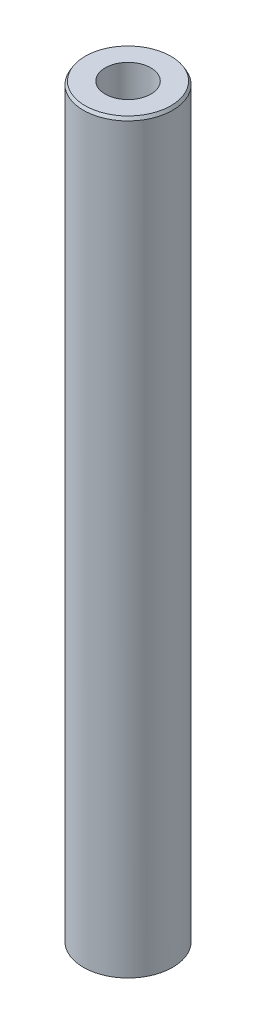
ISO-10303-21;
HEADER;
FILE_DESCRIPTION(('STEP AP214'),'2;1');
FILE_NAME('part.step','',(''),(''),'','','');
FILE_SCHEMA(('AUTOMOTIVE_DESIGN { 1 0 10303 214 1 1 1 1 }'));
ENDSEC;
DATA;
#1=APPLICATION_CONTEXT('core data for automotive mechanical design processes');
#2=APPLICATION_PROTOCOL_DEFINITION('international standard','automotive_design',2000,#1);
#3=PRODUCT_CONTEXT('',#1,'mechanical');
#4=PRODUCT('Part','Part','',(#3));
#5=PRODUCT_RELATED_PRODUCT_CATEGORY('part','',(#4));
#6=PRODUCT_DEFINITION_FORMATION('','',#4);
#7=PRODUCT_DEFINITION_CONTEXT('part definition',#1,'design');
#8=PRODUCT_DEFINITION('design','',#6,#7);
#9=PRODUCT_DEFINITION_SHAPE('','',#8);
#10=(LENGTH_UNIT() NAMED_UNIT(*) SI_UNIT(.MILLI.,.METRE.));
#11=(NAMED_UNIT(*) PLANE_ANGLE_UNIT() SI_UNIT($,.RADIAN.));
#12=(NAMED_UNIT(*) SI_UNIT($,.STERADIAN.) SOLID_ANGLE_UNIT());
#13=UNCERTAINTY_MEASURE_WITH_UNIT(LENGTH_MEASURE(1.E-05),#10,'distance_accuracy_value','');
#14=(GEOMETRIC_REPRESENTATION_CONTEXT(3) GLOBAL_UNCERTAINTY_ASSIGNED_CONTEXT((#13)) GLOBAL_UNIT_ASSIGNED_CONTEXT((#10,
#11,#12)) REPRESENTATION_CONTEXT('',''));
#15=CARTESIAN_POINT('',(0.,0.,0.));
#16=DIRECTION('',(0.,0.,1.));
#17=DIRECTION('',(1.,0.,0.));
#18=AXIS2_PLACEMENT_3D('',#15,#16,#17);
#19=CARTESIAN_POINT('',(0.,167.340942336388,0.));
#20=DIRECTION('',(0.,-1.,0.));
#21=DIRECTION('',(0.,0.,-1.));
#22=AXIS2_PLACEMENT_3D('',#19,#20,#21);
#23=CYLINDRICAL_SURFACE('',#22,10.);
#24=CARTESIAN_POINT('',(0.,166.655777422536,0.));
#25=DIRECTION('',(0.,1.,0.));
#26=DIRECTION('',(0.,0.,1.));
#27=AXIS2_PLACEMENT_3D('',#24,#25,#26);
#28=CIRCLE('',#27,10.);
#29=CARTESIAN_POINT('',(0.,166.655777422536,-10.));
#30=VERTEX_POINT('',#29);
#31=EDGE_CURVE('E50',#30,#30,#28,.F.);
#32=ORIENTED_EDGE('',*,*,#31,.T.);
#33=EDGE_LOOP('',(#32));
#34=FACE_BOUND('',#33,.T.);
#35=CARTESIAN_POINT('',(0.,0.395580147452029,0.));
#36=DIRECTION('',(0.,1.,0.));
#37=DIRECTION('',(0.,0.,1.));
#38=AXIS2_PLACEMENT_3D('',#35,#36,#37);
#39=CIRCLE('',#38,10.);
#40=CARTESIAN_POINT('',(0.,0.395580147452029,10.));
#41=VERTEX_POINT('',#40);
#42=EDGE_CURVE('E51',#41,#41,#39,.T.);
#43=ORIENTED_EDGE('',*,*,#42,.T.);
#44=EDGE_LOOP('',(#43));
#45=FACE_BOUND('',#44,.T.);
#46=ADVANCED_FACE('F39',(#34,#45),#23,.T.);
#47=CARTESIAN_POINT('',(0.,167.340942336388,0.));
#48=DIRECTION('',(0.,1.,0.));
#49=DIRECTION('',(0.,0.,1.));
#50=AXIS2_PLACEMENT_3D('',#47,#48,#49);
#51=PLANE('',#50);
#52=CARTESIAN_POINT('',(0.,167.340942336388,0.));
#53=DIRECTION('',(0.,1.,0.));
#54=DIRECTION('',(0.,0.,1.));
#55=AXIS2_PLACEMENT_3D('',#52,#53,#54);
#56=CIRCLE('',#55,9.60441985254797);
#57=CARTESIAN_POINT('',(0.,167.340942336388,-9.60441985254797));
#58=VERTEX_POINT('',#57);
#59=EDGE_CURVE('E54',#58,#58,#56,.T.);
#60=ORIENTED_EDGE('',*,*,#59,.T.);
#61=EDGE_LOOP('',(#60));
#62=FACE_BOUND('',#61,.T.);
#63=CARTESIAN_POINT('',(0.,167.340942336388,0.));
#64=DIRECTION('',(0.,1.,0.));
#65=DIRECTION('',(0.,0.,1.));
#66=AXIS2_PLACEMENT_3D('',#63,#64,#65);
#67=CIRCLE('',#66,5.11390943637588);
#68=CARTESIAN_POINT('',(0.,167.340942336388,5.11390943637588));
#69=VERTEX_POINT('',#68);
#70=EDGE_CURVE('E58',#69,#69,#67,.T.);
#71=ORIENTED_EDGE('',*,*,#70,.F.);
#72=EDGE_LOOP('',(#71));
#73=FACE_BOUND('',#72,.T.);
#74=ADVANCED_FACE('F69',(#62,#73),#51,.T.);
#75=CARTESIAN_POINT('',(0.,0.,0.));
#76=DIRECTION('',(0.,1.,0.));
#77=DIRECTION('',(0.,0.,1.));
#78=AXIS2_PLACEMENT_3D('',#75,#76,#77);
#79=PLANE('',#78);
#80=CARTESIAN_POINT('',(0.,0.,0.));
#81=DIRECTION('',(0.,1.,0.));
#82=DIRECTION('',(0.,0.,1.));
#83=AXIS2_PLACEMENT_3D('',#80,#81,#82);
#84=CIRCLE('',#83,9.3148350861475);
#85=CARTESIAN_POINT('',(0.,0.,9.3148350861475));
#86=VERTEX_POINT('',#85);
#87=EDGE_CURVE('E10',#86,#86,#84,.F.);
#88=ORIENTED_EDGE('',*,*,#87,.T.);
#89=EDGE_LOOP('',(#88));
#90=FACE_BOUND('',#89,.T.);
#91=CARTESIAN_POINT('',(0.,0.,0.));
#92=DIRECTION('',(0.,1.,0.));
#93=DIRECTION('',(0.,0.,1.));
#94=AXIS2_PLACEMENT_3D('',#91,#92,#93);
#95=CIRCLE('',#94,5.11390943637588);
#96=CARTESIAN_POINT('',(0.,0.,5.11390943637588));
#97=VERTEX_POINT('',#96);
#98=EDGE_CURVE('E63',#97,#97,#95,.T.);
#99=ORIENTED_EDGE('',*,*,#98,.T.);
#100=EDGE_LOOP('',(#99));
#101=FACE_BOUND('',#100,.T.);
#102=ADVANCED_FACE('F75',(#90,#101),#79,.F.);
#103=CARTESIAN_POINT('',(0.,167.340942336388,0.));
#104=DIRECTION('',(0.,-1.,0.));
#105=DIRECTION('',(0.,0.,-1.));
#106=AXIS2_PLACEMENT_3D('',#103,#104,#105);
#107=CYLINDRICAL_SURFACE('',#106,5.11390943637588);
#108=ORIENTED_EDGE('',*,*,#70,.T.);
#109=EDGE_LOOP('',(#108));
#110=FACE_BOUND('',#109,.T.);
#111=ORIENTED_EDGE('',*,*,#98,.F.);
#112=EDGE_LOOP('',(#111));
#113=FACE_BOUND('',#112,.T.);
#114=ADVANCED_FACE('F70',(#110,#113),#107,.F.);
#115=CARTESIAN_POINT('',(0.,167.340942336388,0.));
#116=DIRECTION('',(0.,-1.,0.));
#117=DIRECTION('',(0.,0.,-1.));
#118=AXIS2_PLACEMENT_3D('',#115,#116,#117);
#119=CONICAL_SURFACE('',#118,9.60441985254797,0.523598775598283);
#120=CARTESIAN_POINT('',(0.,166.655777422536,-10.));
#121=CARTESIAN_POINT('',(0.,166.662914557055,-9.99587937346405));
#122=CARTESIAN_POINT('',(0.,166.670051691574,-9.99175874692809));
#123=CARTESIAN_POINT('',(0.,166.684325960613,-9.98351749385617));
#124=CARTESIAN_POINT('',(0.,166.691463095132,-9.97939686732021));
#125=CARTESIAN_POINT('',(0.,166.705737364171,-9.97115561424829));
#126=CARTESIAN_POINT('',(0.,166.71287449869,-9.96703498771234));
#127=CARTESIAN_POINT('',(0.,166.727148767729,-9.95879373464042));
#128=CARTESIAN_POINT('',(0.,166.734285902248,-9.95467310810446));
#129=CARTESIAN_POINT('',(0.,166.748560171287,-9.94643185503254));
#130=CARTESIAN_POINT('',(0.,166.755697305806,-9.94231122849659));
#131=CARTESIAN_POINT('',(0.,166.769971574845,-9.93406997542467));
#132=CARTESIAN_POINT('',(0.,166.777108709364,-9.92994934888871));
#133=CARTESIAN_POINT('',(0.,166.791382978402,-9.92170809581679));
#134=CARTESIAN_POINT('',(0.,166.798520112922,-9.91758746928083));
#135=CARTESIAN_POINT('',(0.,166.81279438196,-9.90934621620891));
#136=CARTESIAN_POINT('',(0.,166.81993151648,-9.90522558967296));
#137=CARTESIAN_POINT('',(0.,166.834205785518,-9.89698433660104));
#138=CARTESIAN_POINT('',(0.,166.841342920038,-9.89286371006508));
#139=CARTESIAN_POINT('',(0.,166.855617189076,-9.88462245699316));
#140=CARTESIAN_POINT('',(0.,166.862754323595,-9.88050183045721));
#141=CARTESIAN_POINT('',(0.,166.877028592634,-9.87226057738529));
#142=CARTESIAN_POINT('',(0.,166.884165727153,-9.86813995084933));
#143=CARTESIAN_POINT('',(0.,166.898439996192,-9.85989869777741));
#144=CARTESIAN_POINT('',(0.,166.905577130711,-9.85577807124145));
#145=CARTESIAN_POINT('',(0.,166.91985139975,-9.84753681816953));
#146=CARTESIAN_POINT('',(0.,166.926988534269,-9.84341619163358));
#147=CARTESIAN_POINT('',(0.,166.941262803308,-9.83517493856166));
#148=CARTESIAN_POINT('',(0.,166.948399937827,-9.8310543120257));
#149=CARTESIAN_POINT('',(0.,166.962674206866,-9.82281305895378));
#150=CARTESIAN_POINT('',(0.,166.969811341385,-9.81869243241783));
#151=CARTESIAN_POINT('',(0.,166.984085610424,-9.81045117934591));
#152=CARTESIAN_POINT('',(0.,166.991222744943,-9.80633055280995));
#153=CARTESIAN_POINT('',(0.,167.005497013981,-9.79808929973803));
#154=CARTESIAN_POINT('',(0.,167.012634148501,-9.79396867320207));
#155=CARTESIAN_POINT('',(0.,167.026908417539,-9.78572742013016));
#156=CARTESIAN_POINT('',(0.,167.034045552059,-9.7816067935942));
#157=CARTESIAN_POINT('',(0.,167.048319821097,-9.77336554052228));
#158=CARTESIAN_POINT('',(0.,167.055456955616,-9.76924491398632));
#159=CARTESIAN_POINT('',(0.,167.069731224655,-9.7610036609144));
#160=CARTESIAN_POINT('',(0.,167.076868359174,-9.75688303437845));
#161=CARTESIAN_POINT('',(0.,167.091142628213,-9.74864178130653));
#162=CARTESIAN_POINT('',(0.,167.098279762732,-9.74452115477057));
#163=CARTESIAN_POINT('',(0.,167.112554031771,-9.73627990169865));
#164=CARTESIAN_POINT('',(0.,167.11969116629,-9.73215927516269));
#165=CARTESIAN_POINT('',(0.,167.133965435329,-9.72391802209077));
#166=CARTESIAN_POINT('',(0.,167.141102569848,-9.71979739555482));
#167=CARTESIAN_POINT('',(0.,167.155376838887,-9.7115561424829));
#168=CARTESIAN_POINT('',(0.,167.162513973406,-9.70743551594694));
#169=CARTESIAN_POINT('',(0.,167.176788242445,-9.69919426287502));
#170=CARTESIAN_POINT('',(0.,167.183925376964,-9.69507363633907));
#171=CARTESIAN_POINT('',(0.,167.198199646002,-9.68683238326715));
#172=CARTESIAN_POINT('',(0.,167.205336780522,-9.68271175673119));
#173=CARTESIAN_POINT('',(0.,167.21961104956,-9.67447050365927));
#174=CARTESIAN_POINT('',(0.,167.22674818408,-9.67034987712331));
#175=CARTESIAN_POINT('',(0.,167.241022453118,-9.6621086240514));
#176=CARTESIAN_POINT('',(0.,167.248159587637,-9.65798799751544));
#177=CARTESIAN_POINT('',(0.,167.262433856676,-9.64974674444352));
#178=CARTESIAN_POINT('',(0.,167.269570991195,-9.64562611790756));
#179=CARTESIAN_POINT('',(0.,167.283845260234,-9.63738486483564));
#180=CARTESIAN_POINT('',(0.,167.290982394753,-9.63326423829969));
#181=CARTESIAN_POINT('',(0.,167.305256663792,-9.62502298522777));
#182=CARTESIAN_POINT('',(0.,167.312393798311,-9.62090235869181));
#183=CARTESIAN_POINT('',(0.,167.32666806735,-9.61266110561989));
#184=CARTESIAN_POINT('',(0.,167.333805201869,-9.60854047908393));
#185=CARTESIAN_POINT('',(0.,167.340942336388,-9.60441985254797));
#186=B_SPLINE_CURVE_WITH_KNOTS('',3,(#120,#121,#122,#123,#124,#125,#126,#127,#128,#129,#130,
#131,#132,#133,#134,#135,#136,#137,#138,#139,#140,#141,#142,#143,#144,#145,#146,#147,#148,#149,
#150,#151,#152,#153,#154,#155,#156,#157,#158,#159,#160,#161,#162,#163,#164,#165,#166,#167,#168,
#169,#170,#171,#172,#173,#174,#175,#176,#177,#178,#179,#180,#181,#182,#183,#184,#185),
.UNSPECIFIED.,.F.,.F.,(4,2,2,2,2,2,2,2,2,2,2,2,2,2,2,2,2,2,2,2,2,2,2,2,2,2,2,2,2,2,2,2,4),(0.,
0.0247237592157434,0.0494475184314869,0.0741712776472535,0.0988950368629969,0.123618796078763,
0.148342555294507,0.17306631451025,0.197790073726017,0.22251383294176,0.247237592157527,
0.27196135137327,0.296685110589014,0.32140886980478,0.346132629020524,0.37085638823629,
0.395580147452034,0.420303906667776,0.445027665883544,0.469751425099287,0.494475184315054,
0.519198943530797,0.54392270274654,0.568646461962307,0.593370221178051,0.618093980393817,
0.642817739609561,0.667541498825303,0.692265258041071,0.716989017256814,0.741712776472581,
0.766436535688324,0.791160294904091),.UNSPECIFIED.);
#187=EDGE_CURVE('BSEAM81',#30,#58,#186,.T.);
#188=ORIENTED_EDGE('',*,*,#31,.F.);
#189=ORIENTED_EDGE('',*,*,#59,.F.);
#190=ORIENTED_EDGE('',*,*,#187,.T.);
#191=ORIENTED_EDGE('',*,*,#187,.F.);
#192=EDGE_LOOP('',(#188,#190,#189,#191));
#193=FACE_BOUND('',#192,.T.);
#194=ADVANCED_FACE('F81',(#193),#119,.T.);
#195=CARTESIAN_POINT('',(0.,0.395580147452029,0.));
#196=DIRECTION('',(0.,1.,0.));
#197=DIRECTION('',(0.,0.,1.));
#198=AXIS2_PLACEMENT_3D('',#195,#196,#197);
#199=CONICAL_SURFACE('',#198,10.,1.0471975511966);
#200=ORIENTED_EDGE('',*,*,#87,.F.);
#201=EDGE_LOOP('',(#200));
#202=FACE_BOUND('',#201,.T.);
#203=ORIENTED_EDGE('',*,*,#42,.F.);
#204=EDGE_LOOP('',(#203));
#205=FACE_BOUND('',#204,.T.);
#206=ADVANCED_FACE('F45',(#202,#205),#199,.T.);
#207=CLOSED_SHELL('',(#46,#74,#102,#114,#194,#206));
#208=MANIFOLD_SOLID_BREP('B2',#207);
#209=ADVANCED_BREP_SHAPE_REPRESENTATION('',(#18,#208),#14);
#210=SHAPE_DEFINITION_REPRESENTATION(#9,#209);
ENDSEC;
END-ISO-10303-21;
